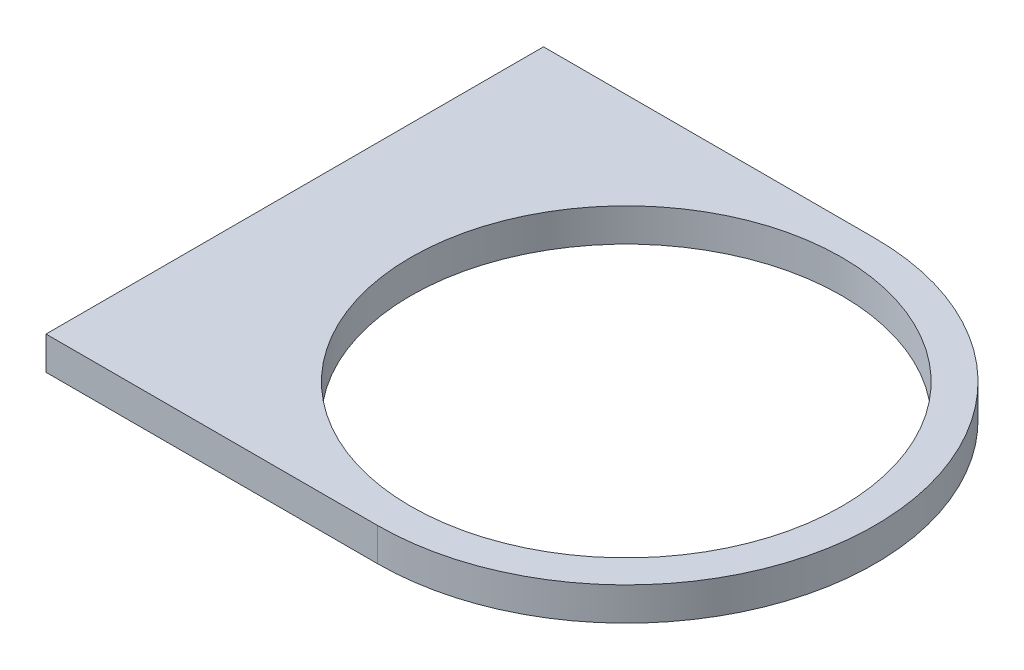
ISO-10303-21;
HEADER;
FILE_DESCRIPTION(('STEP AP214'),'2;1');
FILE_NAME('part.step','',(''),(''),'','','');
FILE_SCHEMA(('AUTOMOTIVE_DESIGN { 1 0 10303 214 1 1 1 1 }'));
ENDSEC;
DATA;
#1=APPLICATION_CONTEXT('core data for automotive mechanical design processes');
#2=APPLICATION_PROTOCOL_DEFINITION('international standard','automotive_design',2000,#1);
#3=PRODUCT_CONTEXT('',#1,'mechanical');
#4=PRODUCT('Part','Part','',(#3));
#5=PRODUCT_RELATED_PRODUCT_CATEGORY('part','',(#4));
#6=PRODUCT_DEFINITION_FORMATION('','',#4);
#7=PRODUCT_DEFINITION_CONTEXT('part definition',#1,'design');
#8=PRODUCT_DEFINITION('design','',#6,#7);
#9=PRODUCT_DEFINITION_SHAPE('','',#8);
#10=(LENGTH_UNIT() NAMED_UNIT(*) SI_UNIT(.MILLI.,.METRE.));
#11=(NAMED_UNIT(*) PLANE_ANGLE_UNIT() SI_UNIT($,.RADIAN.));
#12=(NAMED_UNIT(*) SI_UNIT($,.STERADIAN.) SOLID_ANGLE_UNIT());
#13=UNCERTAINTY_MEASURE_WITH_UNIT(LENGTH_MEASURE(1.E-05),#10,'distance_accuracy_value','');
#14=(GEOMETRIC_REPRESENTATION_CONTEXT(3) GLOBAL_UNCERTAINTY_ASSIGNED_CONTEXT((#13)) GLOBAL_UNIT_ASSIGNED_CONTEXT((#10,
#11,#12)) REPRESENTATION_CONTEXT('',''));
#15=CARTESIAN_POINT('',(0.,0.,0.));
#16=DIRECTION('',(0.,0.,1.));
#17=DIRECTION('',(1.,0.,0.));
#18=AXIS2_PLACEMENT_3D('',#15,#16,#17);
#19=CARTESIAN_POINT('',(155.722607748748,6.35,95.25));
#20=DIRECTION('',(0.,-1.,0.));
#21=DIRECTION('',(1.,0.,0.));
#22=AXIS2_PLACEMENT_3D('',#19,#20,#21);
#23=PLANE('',#22);
#24=CARTESIAN_POINT('',(108.097607748748,6.34999999999999,47.625));
#25=DIRECTION('',(0.,1.,0.));
#26=DIRECTION('',(-1.,0.,0.));
#27=AXIS2_PLACEMENT_3D('',#24,#25,#26);
#28=CIRCLE('',#27,41.275);
#29=CARTESIAN_POINT('',(66.8226077487482,6.34999999999999,47.625));
#30=VERTEX_POINT('',#29);
#31=EDGE_CURVE('E93',#30,#30,#28,.T.);
#32=ORIENTED_EDGE('',*,*,#31,.F.);
#33=EDGE_LOOP('',(#32));
#34=FACE_BOUND('',#33,.T.);
#35=CARTESIAN_POINT('',(108.097607748748,6.34999999999999,47.625));
#36=DIRECTION('',(0.,-1.,0.));
#37=DIRECTION('',(-1.,0.,0.));
#38=AXIS2_PLACEMENT_3D('',#35,#36,#37);
#39=CIRCLE('',#38,47.625);
#40=CARTESIAN_POINT('',(108.097607748748,6.34999999999999,0.));
#41=VERTEX_POINT('',#40);
#42=CARTESIAN_POINT('',(108.097607748748,6.34999999999999,95.25));
#43=VERTEX_POINT('',#42);
#44=EDGE_CURVE('E102',#41,#43,#39,.T.);
#45=ORIENTED_EDGE('',*,*,#44,.F.);
#46=DIRECTION('',(-1.,0.,0.));
#47=VECTOR('',#46,1.);
#48=CARTESIAN_POINT('',(155.722607748748,6.35,0.));
#49=LINE('',#48,#47);
#50=CARTESIAN_POINT('',(44.6197917788018,6.34999999999999,0.));
#51=VERTEX_POINT('',#50);
#52=EDGE_CURVE('E77',#41,#51,#49,.T.);
#53=ORIENTED_EDGE('',*,*,#52,.T.);
#54=DIRECTION('',(0.,0.,-1.));
#55=VECTOR('',#54,1.);
#56=CARTESIAN_POINT('',(44.6197917788018,6.34999999999999,95.25));
#57=LINE('',#56,#55);
#58=CARTESIAN_POINT('',(44.6197917788018,6.34999999999999,95.25));
#59=VERTEX_POINT('',#58);
#60=EDGE_CURVE('E11',#59,#51,#57,.T.);
#61=ORIENTED_EDGE('',*,*,#60,.F.);
#62=DIRECTION('',(-1.,0.,0.));
#63=VECTOR('',#62,1.);
#64=CARTESIAN_POINT('',(155.722607748748,6.35,95.25));
#65=LINE('',#64,#63);
#66=EDGE_CURVE('E85',#43,#59,#65,.T.);
#67=ORIENTED_EDGE('',*,*,#66,.F.);
#68=EDGE_LOOP('',(#45,#53,#61,#67));
#69=FACE_BOUND('',#68,.T.);
#70=ADVANCED_FACE('F33',(#34,#69),#23,.F.);
#71=CARTESIAN_POINT('',(44.6197917788018,0.,95.25));
#72=DIRECTION('',(1.,0.,0.));
#73=DIRECTION('',(0.,0.,-1.));
#74=AXIS2_PLACEMENT_3D('',#71,#72,#73);
#75=PLANE('',#74);
#76=DIRECTION('',(0.,-1.,0.));
#77=VECTOR('',#76,1.);
#78=CARTESIAN_POINT('',(44.6197917788018,0.,0.));
#79=LINE('',#78,#77);
#80=CARTESIAN_POINT('',(44.6197917788018,0.,0.));
#81=VERTEX_POINT('',#80);
#82=EDGE_CURVE('E68',#51,#81,#79,.T.);
#83=ORIENTED_EDGE('',*,*,#82,.T.);
#84=DIRECTION('',(0.,0.,-1.));
#85=VECTOR('',#84,1.);
#86=CARTESIAN_POINT('',(44.6197917788018,0.,95.25));
#87=LINE('',#86,#85);
#88=CARTESIAN_POINT('',(44.6197917788018,0.,95.25));
#89=VERTEX_POINT('',#88);
#90=EDGE_CURVE('E40',#89,#81,#87,.T.);
#91=ORIENTED_EDGE('',*,*,#90,.F.);
#92=DIRECTION('',(0.,-1.,0.));
#93=VECTOR('',#92,1.);
#94=CARTESIAN_POINT('',(44.6197917788018,0.,95.25));
#95=LINE('',#94,#93);
#96=EDGE_CURVE('E56',#59,#89,#95,.T.);
#97=ORIENTED_EDGE('',*,*,#96,.F.);
#98=ORIENTED_EDGE('',*,*,#60,.T.);
#99=EDGE_LOOP('',(#83,#91,#97,#98));
#100=FACE_BOUND('',#99,.T.);
#101=ADVANCED_FACE('F70',(#100),#75,.F.);
#102=CARTESIAN_POINT('',(155.722607748748,0.,95.25));
#103=DIRECTION('',(0.,1.,0.));
#104=DIRECTION('',(-1.,0.,0.));
#105=AXIS2_PLACEMENT_3D('',#102,#103,#104);
#106=PLANE('',#105);
#107=CARTESIAN_POINT('',(108.097607748748,0.,47.625));
#108=DIRECTION('',(0.,1.,0.));
#109=DIRECTION('',(-1.,0.,0.));
#110=AXIS2_PLACEMENT_3D('',#107,#108,#109);
#111=CIRCLE('',#110,41.275);
#112=CARTESIAN_POINT('',(66.8226077487482,0.,47.625));
#113=VERTEX_POINT('',#112);
#114=EDGE_CURVE('E90',#113,#113,#111,.T.);
#115=ORIENTED_EDGE('',*,*,#114,.T.);
#116=EDGE_LOOP('',(#115));
#117=FACE_BOUND('',#116,.T.);
#118=DIRECTION('',(1.,0.,0.));
#119=VECTOR('',#118,1.);
#120=CARTESIAN_POINT('',(155.722607748748,0.,0.));
#121=LINE('',#120,#119);
#122=CARTESIAN_POINT('',(108.097607748748,0.,0.));
#123=VERTEX_POINT('',#122);
#124=EDGE_CURVE('E76',#81,#123,#121,.T.);
#125=ORIENTED_EDGE('',*,*,#124,.T.);
#126=CARTESIAN_POINT('',(108.097607748748,0.,47.625));
#127=DIRECTION('',(0.,-1.,0.));
#128=DIRECTION('',(-1.,0.,0.));
#129=AXIS2_PLACEMENT_3D('',#126,#127,#128);
#130=CIRCLE('',#129,47.625);
#131=CARTESIAN_POINT('',(108.097607748748,0.,95.25));
#132=VERTEX_POINT('',#131);
#133=EDGE_CURVE('E47',#123,#132,#130,.T.);
#134=ORIENTED_EDGE('',*,*,#133,.T.);
#135=DIRECTION('',(1.,0.,0.));
#136=VECTOR('',#135,1.);
#137=CARTESIAN_POINT('',(155.722607748748,0.,95.25));
#138=LINE('',#137,#136);
#139=EDGE_CURVE('E82',#89,#132,#138,.T.);
#140=ORIENTED_EDGE('',*,*,#139,.F.);
#141=ORIENTED_EDGE('',*,*,#90,.T.);
#142=EDGE_LOOP('',(#125,#134,#140,#141));
#143=FACE_BOUND('',#142,.T.);
#144=ADVANCED_FACE('F81',(#117,#143),#106,.F.);
#145=CARTESIAN_POINT('',(0.,0.,95.25));
#146=DIRECTION('',(0.,0.,1.));
#147=DIRECTION('',(1.,0.,0.));
#148=AXIS2_PLACEMENT_3D('',#145,#146,#147);
#149=PLANE('',#148);
#150=DIRECTION('',(0.,1.,0.));
#151=VECTOR('',#150,1.);
#152=CARTESIAN_POINT('',(108.097607748748,0.,95.25));
#153=LINE('',#152,#151);
#154=EDGE_CURVE('E98',#132,#43,#153,.T.);
#155=ORIENTED_EDGE('',*,*,#154,.T.);
#156=ORIENTED_EDGE('',*,*,#66,.T.);
#157=ORIENTED_EDGE('',*,*,#96,.T.);
#158=ORIENTED_EDGE('',*,*,#139,.T.);
#159=EDGE_LOOP('',(#155,#156,#157,#158));
#160=FACE_BOUND('',#159,.T.);
#161=ADVANCED_FACE('F107',(#160),#149,.T.);
#162=CARTESIAN_POINT('',(0.,0.,0.));
#163=DIRECTION('',(0.,0.,1.));
#164=DIRECTION('',(1.,0.,0.));
#165=AXIS2_PLACEMENT_3D('',#162,#163,#164);
#166=PLANE('',#165);
#167=ORIENTED_EDGE('',*,*,#52,.F.);
#168=DIRECTION('',(0.,1.,0.));
#169=VECTOR('',#168,1.);
#170=CARTESIAN_POINT('',(108.097607748748,0.,0.));
#171=LINE('',#170,#169);
#172=EDGE_CURVE('E84',#123,#41,#171,.T.);
#173=ORIENTED_EDGE('',*,*,#172,.F.);
#174=ORIENTED_EDGE('',*,*,#124,.F.);
#175=ORIENTED_EDGE('',*,*,#82,.F.);
#176=EDGE_LOOP('',(#167,#173,#174,#175));
#177=FACE_BOUND('',#176,.T.);
#178=ADVANCED_FACE('F83',(#177),#166,.F.);
#179=CARTESIAN_POINT('',(108.097607748748,0.,47.625));
#180=DIRECTION('',(0.,1.,0.));
#181=DIRECTION('',(-1.,0.,0.));
#182=AXIS2_PLACEMENT_3D('',#179,#180,#181);
#183=CYLINDRICAL_SURFACE('',#182,41.275);
#184=ORIENTED_EDGE('',*,*,#114,.F.);
#185=EDGE_LOOP('',(#184));
#186=FACE_BOUND('',#185,.T.);
#187=ORIENTED_EDGE('',*,*,#31,.T.);
#188=EDGE_LOOP('',(#187));
#189=FACE_BOUND('',#188,.T.);
#190=ADVANCED_FACE('F115',(#186,#189),#183,.F.);
#191=CARTESIAN_POINT('',(108.097607748748,0.,47.625));
#192=DIRECTION('',(0.,1.,0.));
#193=DIRECTION('',(-1.,0.,0.));
#194=AXIS2_PLACEMENT_3D('',#191,#192,#193);
#195=CYLINDRICAL_SURFACE('',#194,47.625);
#196=ORIENTED_EDGE('',*,*,#44,.T.);
#197=ORIENTED_EDGE('',*,*,#154,.F.);
#198=ORIENTED_EDGE('',*,*,#133,.F.);
#199=ORIENTED_EDGE('',*,*,#172,.T.);
#200=EDGE_LOOP('',(#196,#197,#198,#199));
#201=FACE_BOUND('',#200,.T.);
#202=ADVANCED_FACE('F113',(#201),#195,.T.);
#203=CLOSED_SHELL('',(#70,#101,#144,#161,#178,#190,#202));
#204=MANIFOLD_SOLID_BREP('B2',#203);
#205=ADVANCED_BREP_SHAPE_REPRESENTATION('',(#18,#204),#14);
#206=SHAPE_DEFINITION_REPRESENTATION(#9,#205);
ENDSEC;
END-ISO-10303-21;
